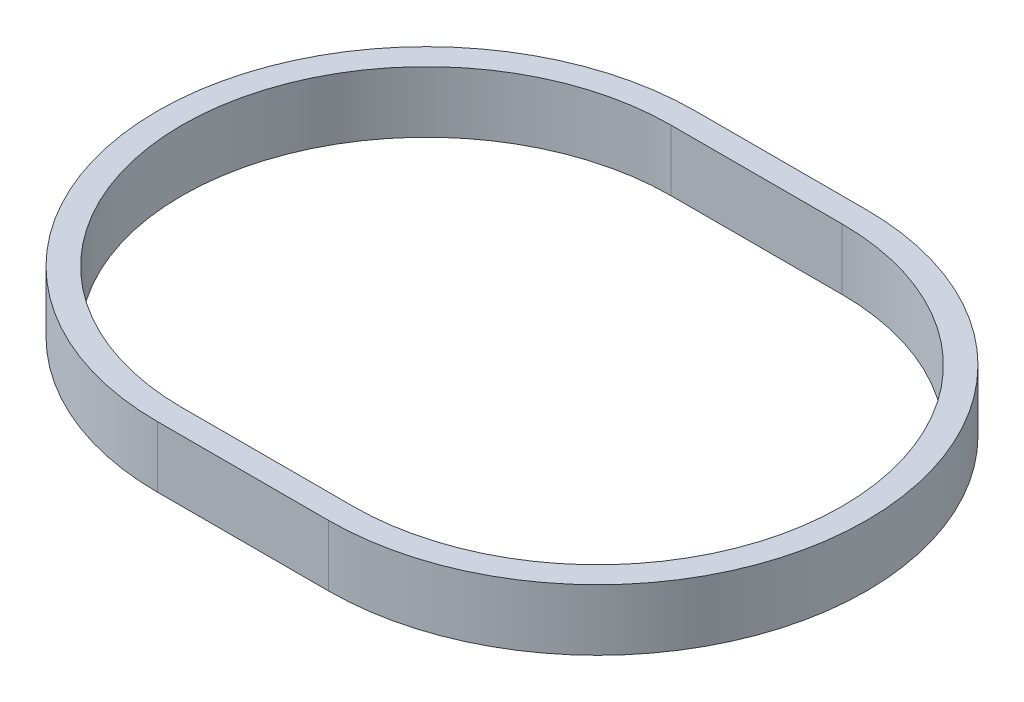
ISO-10303-21;
HEADER;
FILE_DESCRIPTION(('STEP AP214'),'2;1');
FILE_NAME('part.step','',(''),(''),'','','');
FILE_SCHEMA(('AUTOMOTIVE_DESIGN { 1 0 10303 214 1 1 1 1 }'));
ENDSEC;
DATA;
#1=APPLICATION_CONTEXT('core data for automotive mechanical design processes');
#2=APPLICATION_PROTOCOL_DEFINITION('international standard','automotive_design',2000,#1);
#3=PRODUCT_CONTEXT('',#1,'mechanical');
#4=PRODUCT('Part','Part','',(#3));
#5=PRODUCT_RELATED_PRODUCT_CATEGORY('part','',(#4));
#6=PRODUCT_DEFINITION_FORMATION('','',#4);
#7=PRODUCT_DEFINITION_CONTEXT('part definition',#1,'design');
#8=PRODUCT_DEFINITION('design','',#6,#7);
#9=PRODUCT_DEFINITION_SHAPE('','',#8);
#10=(LENGTH_UNIT() NAMED_UNIT(*) SI_UNIT(.MILLI.,.METRE.));
#11=(NAMED_UNIT(*) PLANE_ANGLE_UNIT() SI_UNIT($,.RADIAN.));
#12=(NAMED_UNIT(*) SI_UNIT($,.STERADIAN.) SOLID_ANGLE_UNIT());
#13=UNCERTAINTY_MEASURE_WITH_UNIT(LENGTH_MEASURE(1.E-05),#10,'distance_accuracy_value','');
#14=(GEOMETRIC_REPRESENTATION_CONTEXT(3) GLOBAL_UNCERTAINTY_ASSIGNED_CONTEXT((#13)) GLOBAL_UNIT_ASSIGNED_CONTEXT((#10,
#11,#12)) REPRESENTATION_CONTEXT('',''));
#15=CARTESIAN_POINT('',(0.,0.,0.));
#16=DIRECTION('',(0.,0.,1.));
#17=DIRECTION('',(1.,0.,0.));
#18=AXIS2_PLACEMENT_3D('',#15,#16,#17);
#19=CARTESIAN_POINT('',(0.,5.,0.));
#20=DIRECTION('',(0.,1.,0.));
#21=DIRECTION('',(0.,0.,1.));
#22=AXIS2_PLACEMENT_3D('',#19,#20,#21);
#23=PLANE('',#22);
#24=CARTESIAN_POINT('',(0.,5.,0.));
#25=DIRECTION('',(0.,1.,0.));
#26=DIRECTION('',(0.,0.,1.));
#27=AXIS2_PLACEMENT_3D('',#24,#25,#26);
#28=CIRCLE('',#27,22.);
#29=CARTESIAN_POINT('',(0.,5.,-22.));
#30=VERTEX_POINT('',#29);
#31=CARTESIAN_POINT('',(0.,5.,22.));
#32=VERTEX_POINT('',#31);
#33=EDGE_CURVE('E136',#30,#32,#28,.T.);
#34=ORIENTED_EDGE('',*,*,#33,.T.);
#35=DIRECTION('',(1.,0.,0.));
#36=VECTOR('',#35,1.);
#37=CARTESIAN_POINT('',(0.,5.,22.));
#38=LINE('',#37,#36);
#39=CARTESIAN_POINT('',(14.,5.,22.));
#40=VERTEX_POINT('',#39);
#41=EDGE_CURVE('E139',#32,#40,#38,.T.);
#42=ORIENTED_EDGE('',*,*,#41,.T.);
#43=CARTESIAN_POINT('',(14.,5.,0.));
#44=DIRECTION('',(0.,1.,0.));
#45=DIRECTION('',(0.,0.,1.));
#46=AXIS2_PLACEMENT_3D('',#43,#44,#45);
#47=CIRCLE('',#46,22.);
#48=CARTESIAN_POINT('',(14.,5.,-22.));
#49=VERTEX_POINT('',#48);
#50=EDGE_CURVE('E142',#40,#49,#47,.T.);
#51=ORIENTED_EDGE('',*,*,#50,.T.);
#52=DIRECTION('',(-1.,0.,0.));
#53=VECTOR('',#52,1.);
#54=CARTESIAN_POINT('',(0.,5.,-22.));
#55=LINE('',#54,#53);
#56=EDGE_CURVE('E144',#49,#30,#55,.T.);
#57=ORIENTED_EDGE('',*,*,#56,.T.);
#58=EDGE_LOOP('',(#34,#42,#51,#57));
#59=FACE_BOUND('',#58,.T.);
#60=DIRECTION('',(1.,0.,0.));
#61=VECTOR('',#60,1.);
#62=CARTESIAN_POINT('',(0.,5.,20.));
#63=LINE('',#62,#61);
#64=CARTESIAN_POINT('',(0.,5.,20.));
#65=VERTEX_POINT('',#64);
#66=CARTESIAN_POINT('',(14.,5.,20.));
#67=VERTEX_POINT('',#66);
#68=EDGE_CURVE('E108',#65,#67,#63,.T.);
#69=ORIENTED_EDGE('',*,*,#68,.F.);
#70=CARTESIAN_POINT('',(0.,5.,0.));
#71=DIRECTION('',(0.,1.,0.));
#72=DIRECTION('',(0.,0.,1.));
#73=AXIS2_PLACEMENT_3D('',#70,#71,#72);
#74=CIRCLE('',#73,20.);
#75=CARTESIAN_POINT('',(0.,5.,-20.));
#76=VERTEX_POINT('',#75);
#77=EDGE_CURVE('E100',#76,#65,#74,.T.);
#78=ORIENTED_EDGE('',*,*,#77,.F.);
#79=DIRECTION('',(-1.,0.,0.));
#80=VECTOR('',#79,1.);
#81=CARTESIAN_POINT('',(0.,5.,-20.));
#82=LINE('',#81,#80);
#83=CARTESIAN_POINT('',(14.,5.,-20.));
#84=VERTEX_POINT('',#83);
#85=EDGE_CURVE('E122',#84,#76,#82,.T.);
#86=ORIENTED_EDGE('',*,*,#85,.F.);
#87=CARTESIAN_POINT('',(14.,5.,0.));
#88=DIRECTION('',(0.,1.,0.));
#89=DIRECTION('',(0.,0.,1.));
#90=AXIS2_PLACEMENT_3D('',#87,#88,#89);
#91=CIRCLE('',#90,20.);
#92=EDGE_CURVE('E120',#67,#84,#91,.T.);
#93=ORIENTED_EDGE('',*,*,#92,.F.);
#94=EDGE_LOOP('',(#69,#78,#86,#93));
#95=FACE_BOUND('',#94,.T.);
#96=ADVANCED_FACE('F35',(#59,#95),#23,.T.);
#97=CARTESIAN_POINT('',(0.,0.,0.));
#98=DIRECTION('',(0.,1.,0.));
#99=DIRECTION('',(0.,0.,1.));
#100=AXIS2_PLACEMENT_3D('',#97,#98,#99);
#101=PLANE('',#100);
#102=CARTESIAN_POINT('',(0.,0.,0.));
#103=DIRECTION('',(0.,1.,0.));
#104=DIRECTION('',(0.,0.,1.));
#105=AXIS2_PLACEMENT_3D('',#102,#103,#104);
#106=CIRCLE('',#105,22.);
#107=CARTESIAN_POINT('',(0.,0.,-22.));
#108=VERTEX_POINT('',#107);
#109=CARTESIAN_POINT('',(0.,0.,22.));
#110=VERTEX_POINT('',#109);
#111=EDGE_CURVE('E116',#108,#110,#106,.T.);
#112=ORIENTED_EDGE('',*,*,#111,.F.);
#113=DIRECTION('',(-1.,0.,0.));
#114=VECTOR('',#113,1.);
#115=CARTESIAN_POINT('',(0.,0.,-22.));
#116=LINE('',#115,#114);
#117=CARTESIAN_POINT('',(14.,0.,-22.));
#118=VERTEX_POINT('',#117);
#119=EDGE_CURVE('E140',#118,#108,#116,.T.);
#120=ORIENTED_EDGE('',*,*,#119,.F.);
#121=CARTESIAN_POINT('',(14.,0.,0.));
#122=DIRECTION('',(0.,1.,0.));
#123=DIRECTION('',(0.,0.,1.));
#124=AXIS2_PLACEMENT_3D('',#121,#122,#123);
#125=CIRCLE('',#124,22.);
#126=CARTESIAN_POINT('',(14.,0.,22.));
#127=VERTEX_POINT('',#126);
#128=EDGE_CURVE('E151',#127,#118,#125,.T.);
#129=ORIENTED_EDGE('',*,*,#128,.F.);
#130=DIRECTION('',(1.,0.,0.));
#131=VECTOR('',#130,1.);
#132=CARTESIAN_POINT('',(0.,0.,22.));
#133=LINE('',#132,#131);
#134=EDGE_CURVE('E149',#110,#127,#133,.T.);
#135=ORIENTED_EDGE('',*,*,#134,.F.);
#136=EDGE_LOOP('',(#112,#120,#129,#135));
#137=FACE_BOUND('',#136,.T.);
#138=CARTESIAN_POINT('',(0.,0.,0.));
#139=DIRECTION('',(0.,1.,0.));
#140=DIRECTION('',(0.,0.,1.));
#141=AXIS2_PLACEMENT_3D('',#138,#139,#140);
#142=CIRCLE('',#141,20.);
#143=CARTESIAN_POINT('',(0.,0.,-20.));
#144=VERTEX_POINT('',#143);
#145=CARTESIAN_POINT('',(0.,0.,20.));
#146=VERTEX_POINT('',#145);
#147=EDGE_CURVE('E58',#144,#146,#142,.T.);
#148=ORIENTED_EDGE('',*,*,#147,.T.);
#149=DIRECTION('',(1.,0.,0.));
#150=VECTOR('',#149,1.);
#151=CARTESIAN_POINT('',(0.,0.,20.));
#152=LINE('',#151,#150);
#153=CARTESIAN_POINT('',(14.,0.,20.));
#154=VERTEX_POINT('',#153);
#155=EDGE_CURVE('E115',#146,#154,#152,.T.);
#156=ORIENTED_EDGE('',*,*,#155,.T.);
#157=CARTESIAN_POINT('',(14.,0.,0.));
#158=DIRECTION('',(0.,1.,0.));
#159=DIRECTION('',(0.,0.,1.));
#160=AXIS2_PLACEMENT_3D('',#157,#158,#159);
#161=CIRCLE('',#160,20.);
#162=CARTESIAN_POINT('',(14.,0.,-20.));
#163=VERTEX_POINT('',#162);
#164=EDGE_CURVE('E128',#154,#163,#161,.T.);
#165=ORIENTED_EDGE('',*,*,#164,.T.);
#166=DIRECTION('',(-1.,0.,0.));
#167=VECTOR('',#166,1.);
#168=CARTESIAN_POINT('',(0.,0.,-20.));
#169=LINE('',#168,#167);
#170=EDGE_CURVE('E109',#163,#144,#169,.T.);
#171=ORIENTED_EDGE('',*,*,#170,.T.);
#172=EDGE_LOOP('',(#148,#156,#165,#171));
#173=FACE_BOUND('',#172,.T.);
#174=ADVANCED_FACE('F169',(#137,#173),#101,.F.);
#175=CARTESIAN_POINT('',(0.,5.,0.));
#176=DIRECTION('',(0.,-1.,0.));
#177=DIRECTION('',(0.,0.,-1.));
#178=AXIS2_PLACEMENT_3D('',#175,#176,#177);
#179=CYLINDRICAL_SURFACE('',#178,22.);
#180=ORIENTED_EDGE('',*,*,#111,.T.);
#181=DIRECTION('',(0.,-1.,0.));
#182=VECTOR('',#181,1.);
#183=CARTESIAN_POINT('',(0.,5.,22.));
#184=LINE('',#183,#182);
#185=EDGE_CURVE('E11',#32,#110,#184,.T.);
#186=ORIENTED_EDGE('',*,*,#185,.F.);
#187=ORIENTED_EDGE('',*,*,#33,.F.);
#188=DIRECTION('',(0.,-1.,0.));
#189=VECTOR('',#188,1.);
#190=CARTESIAN_POINT('',(0.,5.,-22.));
#191=LINE('',#190,#189);
#192=EDGE_CURVE('E146',#30,#108,#191,.T.);
#193=ORIENTED_EDGE('',*,*,#192,.T.);
#194=EDGE_LOOP('',(#180,#186,#187,#193));
#195=FACE_BOUND('',#194,.T.);
#196=ADVANCED_FACE('F37',(#195),#179,.T.);
#197=CARTESIAN_POINT('',(0.,5.,22.));
#198=DIRECTION('',(0.,0.,-1.));
#199=DIRECTION('',(-1.,0.,0.));
#200=AXIS2_PLACEMENT_3D('',#197,#198,#199);
#201=PLANE('',#200);
#202=ORIENTED_EDGE('',*,*,#134,.T.);
#203=DIRECTION('',(0.,-1.,0.));
#204=VECTOR('',#203,1.);
#205=CARTESIAN_POINT('',(14.,5.,22.));
#206=LINE('',#205,#204);
#207=EDGE_CURVE('E43',#40,#127,#206,.T.);
#208=ORIENTED_EDGE('',*,*,#207,.F.);
#209=ORIENTED_EDGE('',*,*,#41,.F.);
#210=ORIENTED_EDGE('',*,*,#185,.T.);
#211=EDGE_LOOP('',(#202,#208,#209,#210));
#212=FACE_BOUND('',#211,.T.);
#213=ADVANCED_FACE('F179',(#212),#201,.F.);
#214=CARTESIAN_POINT('',(14.,5.,0.));
#215=DIRECTION('',(0.,-1.,0.));
#216=DIRECTION('',(0.,0.,-1.));
#217=AXIS2_PLACEMENT_3D('',#214,#215,#216);
#218=CYLINDRICAL_SURFACE('',#217,22.);
#219=ORIENTED_EDGE('',*,*,#128,.T.);
#220=DIRECTION('',(0.,-1.,0.));
#221=VECTOR('',#220,1.);
#222=CARTESIAN_POINT('',(14.,5.,-22.));
#223=LINE('',#222,#221);
#224=EDGE_CURVE('E156',#49,#118,#223,.T.);
#225=ORIENTED_EDGE('',*,*,#224,.F.);
#226=ORIENTED_EDGE('',*,*,#50,.F.);
#227=ORIENTED_EDGE('',*,*,#207,.T.);
#228=EDGE_LOOP('',(#219,#225,#226,#227));
#229=FACE_BOUND('',#228,.T.);
#230=ADVANCED_FACE('F163',(#229),#218,.T.);
#231=CARTESIAN_POINT('',(0.,5.,-22.));
#232=DIRECTION('',(0.,0.,1.));
#233=DIRECTION('',(1.,0.,0.));
#234=AXIS2_PLACEMENT_3D('',#231,#232,#233);
#235=PLANE('',#234);
#236=ORIENTED_EDGE('',*,*,#119,.T.);
#237=ORIENTED_EDGE('',*,*,#192,.F.);
#238=ORIENTED_EDGE('',*,*,#56,.F.);
#239=ORIENTED_EDGE('',*,*,#224,.T.);
#240=EDGE_LOOP('',(#236,#237,#238,#239));
#241=FACE_BOUND('',#240,.T.);
#242=ADVANCED_FACE('F173',(#241),#235,.F.);
#243=CARTESIAN_POINT('',(0.,5.,0.));
#244=DIRECTION('',(0.,-1.,0.));
#245=DIRECTION('',(0.,0.,-1.));
#246=AXIS2_PLACEMENT_3D('',#243,#244,#245);
#247=CYLINDRICAL_SURFACE('',#246,20.);
#248=ORIENTED_EDGE('',*,*,#147,.F.);
#249=DIRECTION('',(0.,-1.,0.));
#250=VECTOR('',#249,1.);
#251=CARTESIAN_POINT('',(0.,5.,-20.));
#252=LINE('',#251,#250);
#253=EDGE_CURVE('E104',#76,#144,#252,.T.);
#254=ORIENTED_EDGE('',*,*,#253,.F.);
#255=ORIENTED_EDGE('',*,*,#77,.T.);
#256=DIRECTION('',(0.,-1.,0.));
#257=VECTOR('',#256,1.);
#258=CARTESIAN_POINT('',(0.,5.,20.));
#259=LINE('',#258,#257);
#260=EDGE_CURVE('E103',#65,#146,#259,.T.);
#261=ORIENTED_EDGE('',*,*,#260,.T.);
#262=EDGE_LOOP('',(#248,#254,#255,#261));
#263=FACE_BOUND('',#262,.T.);
#264=ADVANCED_FACE('F102',(#263),#247,.F.);
#265=CARTESIAN_POINT('',(0.,5.,20.));
#266=DIRECTION('',(0.,0.,-1.));
#267=DIRECTION('',(-1.,0.,0.));
#268=AXIS2_PLACEMENT_3D('',#265,#266,#267);
#269=PLANE('',#268);
#270=ORIENTED_EDGE('',*,*,#155,.F.);
#271=ORIENTED_EDGE('',*,*,#260,.F.);
#272=ORIENTED_EDGE('',*,*,#68,.T.);
#273=DIRECTION('',(0.,-1.,0.));
#274=VECTOR('',#273,1.);
#275=CARTESIAN_POINT('',(14.,5.,20.));
#276=LINE('',#275,#274);
#277=EDGE_CURVE('E117',#67,#154,#276,.T.);
#278=ORIENTED_EDGE('',*,*,#277,.T.);
#279=EDGE_LOOP('',(#270,#271,#272,#278));
#280=FACE_BOUND('',#279,.T.);
#281=ADVANCED_FACE('F112',(#280),#269,.T.);
#282=CARTESIAN_POINT('',(14.,5.,0.));
#283=DIRECTION('',(0.,-1.,0.));
#284=DIRECTION('',(0.,0.,-1.));
#285=AXIS2_PLACEMENT_3D('',#282,#283,#284);
#286=CYLINDRICAL_SURFACE('',#285,20.);
#287=ORIENTED_EDGE('',*,*,#164,.F.);
#288=ORIENTED_EDGE('',*,*,#277,.F.);
#289=ORIENTED_EDGE('',*,*,#92,.T.);
#290=DIRECTION('',(0.,-1.,0.));
#291=VECTOR('',#290,1.);
#292=CARTESIAN_POINT('',(14.,5.,-20.));
#293=LINE('',#292,#291);
#294=EDGE_CURVE('E50',#84,#163,#293,.T.);
#295=ORIENTED_EDGE('',*,*,#294,.T.);
#296=EDGE_LOOP('',(#287,#288,#289,#295));
#297=FACE_BOUND('',#296,.T.);
#298=ADVANCED_FACE('F202',(#297),#286,.F.);
#299=CARTESIAN_POINT('',(0.,5.,-20.));
#300=DIRECTION('',(0.,0.,1.));
#301=DIRECTION('',(1.,0.,0.));
#302=AXIS2_PLACEMENT_3D('',#299,#300,#301);
#303=PLANE('',#302);
#304=ORIENTED_EDGE('',*,*,#170,.F.);
#305=ORIENTED_EDGE('',*,*,#294,.F.);
#306=ORIENTED_EDGE('',*,*,#85,.T.);
#307=ORIENTED_EDGE('',*,*,#253,.T.);
#308=EDGE_LOOP('',(#304,#305,#306,#307));
#309=FACE_BOUND('',#308,.T.);
#310=ADVANCED_FACE('F206',(#309),#303,.T.);
#311=CLOSED_SHELL('',(#96,#174,#196,#213,#230,#242,#264,#281,#298,#310));
#312=MANIFOLD_SOLID_BREP('B2',#311);
#313=ADVANCED_BREP_SHAPE_REPRESENTATION('',(#18,#312),#14);
#314=SHAPE_DEFINITION_REPRESENTATION(#9,#313);
ENDSEC;
END-ISO-10303-21;
